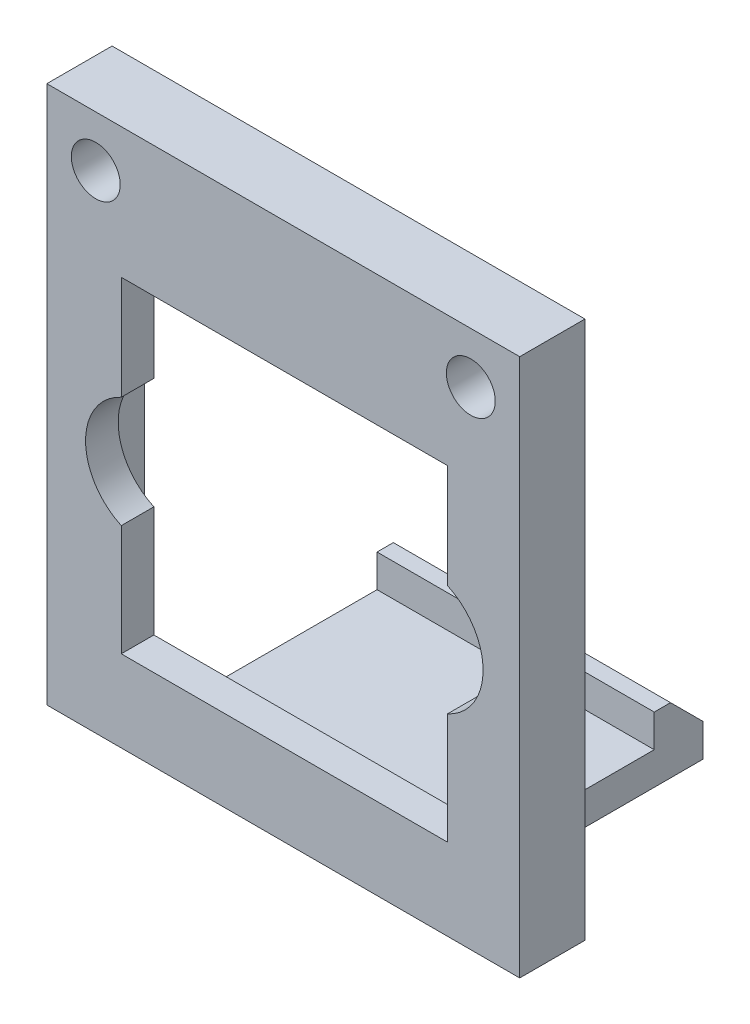
ISO-10303-21;
HEADER;
FILE_DESCRIPTION(('STEP AP214'),'2;1');
FILE_NAME('part.step','',(''),(''),'','','');
FILE_SCHEMA(('AUTOMOTIVE_DESIGN { 1 0 10303 214 1 1 1 1 }'));
ENDSEC;
DATA;
#1=APPLICATION_CONTEXT('core data for automotive mechanical design processes');
#2=APPLICATION_PROTOCOL_DEFINITION('international standard','automotive_design',2000,#1);
#3=PRODUCT_CONTEXT('',#1,'mechanical');
#4=PRODUCT('Part','Part','',(#3));
#5=PRODUCT_RELATED_PRODUCT_CATEGORY('part','',(#4));
#6=PRODUCT_DEFINITION_FORMATION('','',#4);
#7=PRODUCT_DEFINITION_CONTEXT('part definition',#1,'design');
#8=PRODUCT_DEFINITION('design','',#6,#7);
#9=PRODUCT_DEFINITION_SHAPE('','',#8);
#10=(LENGTH_UNIT() NAMED_UNIT(*) SI_UNIT(.MILLI.,.METRE.));
#11=(NAMED_UNIT(*) PLANE_ANGLE_UNIT() SI_UNIT($,.RADIAN.));
#12=(NAMED_UNIT(*) SI_UNIT($,.STERADIAN.) SOLID_ANGLE_UNIT());
#13=UNCERTAINTY_MEASURE_WITH_UNIT(LENGTH_MEASURE(1.E-05),#10,'distance_accuracy_value','');
#14=(GEOMETRIC_REPRESENTATION_CONTEXT(3) GLOBAL_UNCERTAINTY_ASSIGNED_CONTEXT((#13)) GLOBAL_UNIT_ASSIGNED_CONTEXT((#10,
#11,#12)) REPRESENTATION_CONTEXT('',''));
#15=CARTESIAN_POINT('',(0.,0.,0.));
#16=DIRECTION('',(0.,0.,1.));
#17=DIRECTION('',(1.,0.,0.));
#18=AXIS2_PLACEMENT_3D('',#15,#16,#17);
#19=CARTESIAN_POINT('',(0.,0.,0.));
#20=DIRECTION('',(0.,0.,-1.));
#21=DIRECTION('',(-1.,0.,0.));
#22=AXIS2_PLACEMENT_3D('',#19,#20,#21);
#23=PLANE('',#22);
#24=CARTESIAN_POINT('',(3.,52.385,0.));
#25=DIRECTION('',(0.,0.,1.));
#26=DIRECTION('',(1.,0.,0.));
#27=AXIS2_PLACEMENT_3D('',#24,#25,#26);
#28=CIRCLE('',#27,1.5);
#29=CARTESIAN_POINT('',(4.5,52.385,0.));
#30=VERTEX_POINT('',#29);
#31=EDGE_CURVE('E327',#30,#30,#28,.T.);
#32=ORIENTED_EDGE('',*,*,#31,.T.);
#33=EDGE_LOOP('',(#32));
#34=FACE_BOUND('',#33,.T.);
#35=CARTESIAN_POINT('',(26.,52.385,0.));
#36=DIRECTION('',(0.,0.,1.));
#37=DIRECTION('',(-1.,0.,0.));
#38=AXIS2_PLACEMENT_3D('',#35,#36,#37);
#39=CIRCLE('',#38,1.5);
#40=CARTESIAN_POINT('',(24.5,52.385,0.));
#41=VERTEX_POINT('',#40);
#42=EDGE_CURVE('E335',#41,#41,#39,.T.);
#43=ORIENTED_EDGE('',*,*,#42,.T.);
#44=EDGE_LOOP('',(#43));
#45=FACE_BOUND('',#44,.T.);
#46=DIRECTION('',(0.,1.,0.));
#47=VECTOR('',#46,1.);
#48=CARTESIAN_POINT('',(29.,0.,0.));
#49=LINE('',#48,#47);
#50=CARTESIAN_POINT('',(29.,22.5,0.));
#51=VERTEX_POINT('',#50);
#52=CARTESIAN_POINT('',(29.,55.5,0.));
#53=VERTEX_POINT('',#52);
#54=EDGE_CURVE('E220',#51,#53,#49,.T.);
#55=ORIENTED_EDGE('',*,*,#54,.F.);
#56=DIRECTION('',(-1.,0.,0.));
#57=VECTOR('',#56,1.);
#58=CARTESIAN_POINT('',(0.,22.5,0.));
#59=LINE('',#58,#57);
#60=CARTESIAN_POINT('',(23.,22.5,0.));
#61=VERTEX_POINT('',#60);
#62=EDGE_CURVE('E212',#51,#61,#59,.T.);
#63=ORIENTED_EDGE('',*,*,#62,.T.);
#64=DIRECTION('',(0.,1.,0.));
#65=VECTOR('',#64,1.);
#66=CARTESIAN_POINT('',(23.,24.5,0.));
#67=LINE('',#66,#65);
#68=CARTESIAN_POINT('',(23.,24.5,0.));
#69=VERTEX_POINT('',#68);
#70=EDGE_CURVE('E194',#61,#69,#67,.T.);
#71=ORIENTED_EDGE('',*,*,#70,.T.);
#72=DIRECTION('',(-1.,0.,0.));
#73=VECTOR('',#72,1.);
#74=CARTESIAN_POINT('',(27.,24.5,0.));
#75=LINE('',#74,#73);
#76=CARTESIAN_POINT('',(27.,24.5,0.));
#77=VERTEX_POINT('',#76);
#78=EDGE_CURVE('E313',#77,#69,#75,.T.);
#79=ORIENTED_EDGE('',*,*,#78,.F.);
#80=DIRECTION('',(0.,-1.,0.));
#81=VECTOR('',#80,1.);
#82=CARTESIAN_POINT('',(27.,49.5,0.));
#83=LINE('',#82,#81);
#84=CARTESIAN_POINT('',(27.,49.5,0.));
#85=VERTEX_POINT('',#84);
#86=EDGE_CURVE('E257',#85,#77,#83,.T.);
#87=ORIENTED_EDGE('',*,*,#86,.F.);
#88=DIRECTION('',(1.,0.,0.));
#89=VECTOR('',#88,1.);
#90=CARTESIAN_POINT('',(27.,49.5,0.));
#91=LINE('',#90,#89);
#92=CARTESIAN_POINT('',(1.99999999999999,49.5,0.));
#93=VERTEX_POINT('',#92);
#94=EDGE_CURVE('E298',#93,#85,#91,.T.);
#95=ORIENTED_EDGE('',*,*,#94,.F.);
#96=DIRECTION('',(0.,1.,0.));
#97=VECTOR('',#96,1.);
#98=CARTESIAN_POINT('',(1.99999999999999,49.5,0.));
#99=LINE('',#98,#97);
#100=CARTESIAN_POINT('',(2.,24.5,0.));
#101=VERTEX_POINT('',#100);
#102=EDGE_CURVE('E310',#101,#93,#99,.T.);
#103=ORIENTED_EDGE('',*,*,#102,.F.);
#104=CARTESIAN_POINT('',(6.00000000000001,24.5,0.));
#105=VERTEX_POINT('',#104);
#106=EDGE_CURVE('E249',#105,#101,#75,.T.);
#107=ORIENTED_EDGE('',*,*,#106,.F.);
#108=DIRECTION('',(0.,-1.,0.));
#109=VECTOR('',#108,1.);
#110=CARTESIAN_POINT('',(6.00000000000001,24.5,0.));
#111=LINE('',#110,#109);
#112=CARTESIAN_POINT('',(6.00000000000001,22.5,0.));
#113=VERTEX_POINT('',#112);
#114=EDGE_CURVE('E206',#105,#113,#111,.T.);
#115=ORIENTED_EDGE('',*,*,#114,.T.);
#116=CARTESIAN_POINT('',(0.,22.5,0.));
#117=VERTEX_POINT('',#116);
#118=EDGE_CURVE('E60',#113,#117,#59,.T.);
#119=ORIENTED_EDGE('',*,*,#118,.T.);
#120=DIRECTION('',(0.,-1.,0.));
#121=VECTOR('',#120,1.);
#122=CARTESIAN_POINT('',(0.,0.,0.));
#123=LINE('',#122,#121);
#124=CARTESIAN_POINT('',(0.,55.5,0.));
#125=VERTEX_POINT('',#124);
#126=EDGE_CURVE('E325',#125,#117,#123,.T.);
#127=ORIENTED_EDGE('',*,*,#126,.F.);
#128=DIRECTION('',(-1.,0.,0.));
#129=VECTOR('',#128,1.);
#130=CARTESIAN_POINT('',(0.,55.5,0.));
#131=LINE('',#130,#129);
#132=EDGE_CURVE('E321',#53,#125,#131,.T.);
#133=ORIENTED_EDGE('',*,*,#132,.F.);
#134=EDGE_LOOP('',(#55,#63,#71,#79,#87,#95,#103,#107,#115,#119,#127,#133));
#135=FACE_BOUND('',#134,.T.);
#136=ADVANCED_FACE('F34',(#34,#45,#135),#23,.T.);
#137=CARTESIAN_POINT('',(0.,0.,4.));
#138=DIRECTION('',(0.,0.,-1.));
#139=DIRECTION('',(-1.,0.,0.));
#140=AXIS2_PLACEMENT_3D('',#137,#138,#139);
#141=PLANE('',#140);
#142=CARTESIAN_POINT('',(6.12389813927912,37.7184229476218,4.));
#143=DIRECTION('',(0.,0.,-1.));
#144=DIRECTION('',(-1.,0.,0.));
#145=AXIS2_PLACEMENT_3D('',#142,#143,#144);
#146=CIRCLE('',#145,3.75);
#147=CARTESIAN_POINT('',(4.56389813927912,41.1285402476571,4.));
#148=VERTEX_POINT('',#147);
#149=CARTESIAN_POINT('',(4.56389813927912,34.3083056475865,4.));
#150=VERTEX_POINT('',#149);
#151=EDGE_CURVE('E341',#148,#150,#146,.F.);
#152=ORIENTED_EDGE('',*,*,#151,.F.);
#153=DIRECTION('',(0.,-1.,0.));
#154=VECTOR('',#153,1.);
#155=CARTESIAN_POINT('',(4.56389813927913,0.,4.));
#156=LINE('',#155,#154);
#157=CARTESIAN_POINT('',(4.56389813927911,47.5,4.));
#158=VERTEX_POINT('',#157);
#159=EDGE_CURVE('E358',#158,#148,#156,.T.);
#160=ORIENTED_EDGE('',*,*,#159,.F.);
#161=DIRECTION('',(-1.,0.,0.));
#162=VECTOR('',#161,1.);
#163=CARTESIAN_POINT('',(0.,47.5,4.));
#164=LINE('',#163,#162);
#165=CARTESIAN_POINT('',(24.5638981392791,47.5,4.));
#166=VERTEX_POINT('',#165);
#167=EDGE_CURVE('E355',#166,#158,#164,.T.);
#168=ORIENTED_EDGE('',*,*,#167,.F.);
#169=DIRECTION('',(0.,1.,0.));
#170=VECTOR('',#169,1.);
#171=CARTESIAN_POINT('',(24.5638981392791,0.,4.));
#172=LINE('',#171,#170);
#173=CARTESIAN_POINT('',(24.5638981392791,41.1285402476571,4.));
#174=VERTEX_POINT('',#173);
#175=EDGE_CURVE('E353',#174,#166,#172,.T.);
#176=ORIENTED_EDGE('',*,*,#175,.F.);
#177=CARTESIAN_POINT('',(23.0038981392791,37.7184229476218,4.));
#178=DIRECTION('',(0.,0.,-1.));
#179=DIRECTION('',(-1.,0.,0.));
#180=AXIS2_PLACEMENT_3D('',#177,#178,#179);
#181=CIRCLE('',#180,3.75);
#182=CARTESIAN_POINT('',(24.5638981392791,34.3083056475865,4.));
#183=VERTEX_POINT('',#182);
#184=EDGE_CURVE('E351',#183,#174,#181,.F.);
#185=ORIENTED_EDGE('',*,*,#184,.F.);
#186=DIRECTION('',(0.,1.,0.));
#187=VECTOR('',#186,1.);
#188=CARTESIAN_POINT('',(24.5638981392791,0.,4.));
#189=LINE('',#188,#187);
#190=CARTESIAN_POINT('',(24.5638981392791,27.5,4.));
#191=VERTEX_POINT('',#190);
#192=EDGE_CURVE('E349',#191,#183,#189,.T.);
#193=ORIENTED_EDGE('',*,*,#192,.F.);
#194=DIRECTION('',(1.,0.,0.));
#195=VECTOR('',#194,1.);
#196=CARTESIAN_POINT('',(0.,27.5,4.));
#197=LINE('',#196,#195);
#198=CARTESIAN_POINT('',(4.56389813927912,27.5,4.));
#199=VERTEX_POINT('',#198);
#200=EDGE_CURVE('E347',#199,#191,#197,.T.);
#201=ORIENTED_EDGE('',*,*,#200,.F.);
#202=DIRECTION('',(0.,-1.,0.));
#203=VECTOR('',#202,1.);
#204=CARTESIAN_POINT('',(4.56389813927912,0.,4.));
#205=LINE('',#204,#203);
#206=EDGE_CURVE('E345',#150,#199,#205,.T.);
#207=ORIENTED_EDGE('',*,*,#206,.F.);
#208=EDGE_LOOP('',(#152,#160,#168,#176,#185,#193,#201,#207));
#209=FACE_BOUND('',#208,.T.);
#210=CARTESIAN_POINT('',(26.,52.385,4.));
#211=DIRECTION('',(0.,0.,1.));
#212=DIRECTION('',(-1.,0.,0.));
#213=AXIS2_PLACEMENT_3D('',#210,#211,#212);
#214=CIRCLE('',#213,1.5);
#215=CARTESIAN_POINT('',(24.5,52.385,4.));
#216=VERTEX_POINT('',#215);
#217=EDGE_CURVE('E338',#216,#216,#214,.T.);
#218=ORIENTED_EDGE('',*,*,#217,.F.);
#219=EDGE_LOOP('',(#218));
#220=FACE_BOUND('',#219,.T.);
#221=CARTESIAN_POINT('',(3.,52.385,4.));
#222=DIRECTION('',(0.,0.,1.));
#223=DIRECTION('',(1.,0.,0.));
#224=AXIS2_PLACEMENT_3D('',#221,#222,#223);
#225=CIRCLE('',#224,1.5);
#226=CARTESIAN_POINT('',(4.5,52.385,4.));
#227=VERTEX_POINT('',#226);
#228=EDGE_CURVE('E332',#227,#227,#225,.T.);
#229=ORIENTED_EDGE('',*,*,#228,.F.);
#230=EDGE_LOOP('',(#229));
#231=FACE_BOUND('',#230,.T.);
#232=DIRECTION('',(-1.,0.,0.));
#233=VECTOR('',#232,1.);
#234=CARTESIAN_POINT('',(0.,22.5,4.));
#235=LINE('',#234,#233);
#236=CARTESIAN_POINT('',(29.,22.5,4.));
#237=VERTEX_POINT('',#236);
#238=CARTESIAN_POINT('',(0.,22.5,4.));
#239=VERTEX_POINT('',#238);
#240=EDGE_CURVE('E226',#237,#239,#235,.T.);
#241=ORIENTED_EDGE('',*,*,#240,.F.);
#242=DIRECTION('',(0.,1.,0.));
#243=VECTOR('',#242,1.);
#244=CARTESIAN_POINT('',(29.,0.,4.));
#245=LINE('',#244,#243);
#246=CARTESIAN_POINT('',(29.,55.5,4.));
#247=VERTEX_POINT('',#246);
#248=EDGE_CURVE('E329',#237,#247,#245,.T.);
#249=ORIENTED_EDGE('',*,*,#248,.T.);
#250=DIRECTION('',(-1.,0.,0.));
#251=VECTOR('',#250,1.);
#252=CARTESIAN_POINT('',(0.,55.5,4.));
#253=LINE('',#252,#251);
#254=CARTESIAN_POINT('',(0.,55.5,4.));
#255=VERTEX_POINT('',#254);
#256=EDGE_CURVE('E320',#247,#255,#253,.T.);
#257=ORIENTED_EDGE('',*,*,#256,.T.);
#258=DIRECTION('',(0.,-1.,0.));
#259=VECTOR('',#258,1.);
#260=CARTESIAN_POINT('',(0.,0.,4.));
#261=LINE('',#260,#259);
#262=EDGE_CURVE('E323',#255,#239,#261,.T.);
#263=ORIENTED_EDGE('',*,*,#262,.T.);
#264=EDGE_LOOP('',(#241,#249,#257,#263));
#265=FACE_BOUND('',#264,.T.);
#266=ADVANCED_FACE('F442',(#209,#220,#231,#265),#141,.F.);
#267=CARTESIAN_POINT('',(0.,0.,4.));
#268=DIRECTION('',(1.,0.,0.));
#269=DIRECTION('',(0.,0.,-1.));
#270=AXIS2_PLACEMENT_3D('',#267,#268,#269);
#271=PLANE('',#270);
#272=DIRECTION('',(0.,0.,-1.));
#273=VECTOR('',#272,1.);
#274=CARTESIAN_POINT('',(0.,22.5,4.));
#275=LINE('',#274,#273);
#276=EDGE_CURVE('E52',#239,#117,#275,.T.);
#277=ORIENTED_EDGE('',*,*,#276,.F.);
#278=ORIENTED_EDGE('',*,*,#262,.F.);
#279=DIRECTION('',(0.,0.,-1.));
#280=VECTOR('',#279,1.);
#281=CARTESIAN_POINT('',(0.,55.5,4.));
#282=LINE('',#281,#280);
#283=EDGE_CURVE('E317',#255,#125,#282,.T.);
#284=ORIENTED_EDGE('',*,*,#283,.T.);
#285=ORIENTED_EDGE('',*,*,#126,.T.);
#286=EDGE_LOOP('',(#277,#278,#284,#285));
#287=FACE_BOUND('',#286,.T.);
#288=ADVANCED_FACE('F36',(#287),#271,.F.);
#289=CARTESIAN_POINT('',(29.,0.,4.));
#290=DIRECTION('',(-1.,0.,0.));
#291=DIRECTION('',(0.,0.,1.));
#292=AXIS2_PLACEMENT_3D('',#289,#290,#291);
#293=PLANE('',#292);
#294=DIRECTION('',(0.,0.,1.));
#295=VECTOR('',#294,1.);
#296=CARTESIAN_POINT('',(29.,22.5,4.));
#297=LINE('',#296,#295);
#298=EDGE_CURVE('E222',#51,#237,#297,.T.);
#299=ORIENTED_EDGE('',*,*,#298,.F.);
#300=ORIENTED_EDGE('',*,*,#54,.T.);
#301=DIRECTION('',(0.,0.,-1.));
#302=VECTOR('',#301,1.);
#303=CARTESIAN_POINT('',(29.,55.5,4.));
#304=LINE('',#303,#302);
#305=EDGE_CURVE('E44',#247,#53,#304,.T.);
#306=ORIENTED_EDGE('',*,*,#305,.F.);
#307=ORIENTED_EDGE('',*,*,#248,.F.);
#308=EDGE_LOOP('',(#299,#300,#306,#307));
#309=FACE_BOUND('',#308,.T.);
#310=ADVANCED_FACE('F458',(#309),#293,.F.);
#311=CARTESIAN_POINT('',(6.12389813927912,37.7184229476218,10.));
#312=DIRECTION('',(0.,0.,-1.));
#313=DIRECTION('',(-1.,0.,0.));
#314=AXIS2_PLACEMENT_3D('',#311,#312,#313);
#315=CYLINDRICAL_SURFACE('',#314,3.75);
#316=DIRECTION('',(0.,0.,-1.));
#317=VECTOR('',#316,1.);
#318=CARTESIAN_POINT('',(4.56389813927912,34.3083056475865,10.));
#319=LINE('',#318,#317);
#320=CARTESIAN_POINT('',(4.56389813927912,34.3083056475865,2.));
#321=VERTEX_POINT('',#320);
#322=EDGE_CURVE('E360',#150,#321,#319,.T.);
#323=ORIENTED_EDGE('',*,*,#322,.T.);
#324=CARTESIAN_POINT('',(6.12389813927912,37.7184229476218,2.));
#325=DIRECTION('',(0.,0.,-1.));
#326=DIRECTION('',(-1.,0.,0.));
#327=AXIS2_PLACEMENT_3D('',#324,#325,#326);
#328=CIRCLE('',#327,3.75);
#329=CARTESIAN_POINT('',(4.56389813927912,41.1285402476571,2.));
#330=VERTEX_POINT('',#329);
#331=EDGE_CURVE('E384',#321,#330,#328,.T.);
#332=ORIENTED_EDGE('',*,*,#331,.T.);
#333=DIRECTION('',(0.,0.,-1.));
#334=VECTOR('',#333,1.);
#335=CARTESIAN_POINT('',(4.56389813927912,41.1285402476571,10.));
#336=LINE('',#335,#334);
#337=EDGE_CURVE('E381',#148,#330,#336,.T.);
#338=ORIENTED_EDGE('',*,*,#337,.F.);
#339=ORIENTED_EDGE('',*,*,#151,.T.);
#340=EDGE_LOOP('',(#323,#332,#338,#339));
#341=FACE_BOUND('',#340,.T.);
#342=ADVANCED_FACE('F460',(#341),#315,.F.);
#343=CARTESIAN_POINT('',(4.56389813927912,34.3083056475865,10.));
#344=DIRECTION('',(1.,0.,0.));
#345=DIRECTION('',(0.,0.,-1.));
#346=AXIS2_PLACEMENT_3D('',#343,#344,#345);
#347=PLANE('',#346);
#348=DIRECTION('',(0.,0.,-1.));
#349=VECTOR('',#348,1.);
#350=CARTESIAN_POINT('',(4.56389813927912,27.5,10.));
#351=LINE('',#350,#349);
#352=CARTESIAN_POINT('',(4.56389813927912,27.5,2.));
#353=VERTEX_POINT('',#352);
#354=EDGE_CURVE('E363',#199,#353,#351,.T.);
#355=ORIENTED_EDGE('',*,*,#354,.T.);
#356=DIRECTION('',(0.,1.,0.));
#357=VECTOR('',#356,1.);
#358=CARTESIAN_POINT('',(4.56389813927912,34.3083056475865,2.));
#359=LINE('',#358,#357);
#360=EDGE_CURVE('E387',#353,#321,#359,.T.);
#361=ORIENTED_EDGE('',*,*,#360,.T.);
#362=ORIENTED_EDGE('',*,*,#322,.F.);
#363=ORIENTED_EDGE('',*,*,#206,.T.);
#364=EDGE_LOOP('',(#355,#361,#362,#363));
#365=FACE_BOUND('',#364,.T.);
#366=ADVANCED_FACE('F466',(#365),#347,.T.);
#367=CARTESIAN_POINT('',(4.56389813927912,27.5,10.));
#368=DIRECTION('',(0.,1.,0.));
#369=DIRECTION('',(-1.,0.,0.));
#370=AXIS2_PLACEMENT_3D('',#367,#368,#369);
#371=PLANE('',#370);
#372=DIRECTION('',(0.,0.,-1.));
#373=VECTOR('',#372,1.);
#374=CARTESIAN_POINT('',(24.5638981392791,27.5,10.));
#375=LINE('',#374,#373);
#376=CARTESIAN_POINT('',(24.5638981392791,27.5,2.));
#377=VERTEX_POINT('',#376);
#378=EDGE_CURVE('E366',#191,#377,#375,.T.);
#379=ORIENTED_EDGE('',*,*,#378,.T.);
#380=DIRECTION('',(-1.,0.,0.));
#381=VECTOR('',#380,1.);
#382=CARTESIAN_POINT('',(4.56389813927912,27.5,2.));
#383=LINE('',#382,#381);
#384=EDGE_CURVE('E390',#377,#353,#383,.T.);
#385=ORIENTED_EDGE('',*,*,#384,.T.);
#386=ORIENTED_EDGE('',*,*,#354,.F.);
#387=ORIENTED_EDGE('',*,*,#200,.T.);
#388=EDGE_LOOP('',(#379,#385,#386,#387));
#389=FACE_BOUND('',#388,.T.);
#390=ADVANCED_FACE('F623',(#389),#371,.T.);
#391=CARTESIAN_POINT('',(24.5638981392791,34.3083056475865,10.));
#392=DIRECTION('',(-1.,0.,0.));
#393=DIRECTION('',(0.,-1.,0.));
#394=AXIS2_PLACEMENT_3D('',#391,#392,#393);
#395=PLANE('',#394);
#396=DIRECTION('',(0.,0.,-1.));
#397=VECTOR('',#396,1.);
#398=CARTESIAN_POINT('',(24.5638981392791,34.3083056475865,10.));
#399=LINE('',#398,#397);
#400=CARTESIAN_POINT('',(24.5638981392791,34.3083056475865,2.));
#401=VERTEX_POINT('',#400);
#402=EDGE_CURVE('E369',#183,#401,#399,.T.);
#403=ORIENTED_EDGE('',*,*,#402,.T.);
#404=DIRECTION('',(0.,-1.,0.));
#405=VECTOR('',#404,1.);
#406=CARTESIAN_POINT('',(24.5638981392791,34.3083056475865,2.));
#407=LINE('',#406,#405);
#408=EDGE_CURVE('E393',#401,#377,#407,.T.);
#409=ORIENTED_EDGE('',*,*,#408,.T.);
#410=ORIENTED_EDGE('',*,*,#378,.F.);
#411=ORIENTED_EDGE('',*,*,#192,.T.);
#412=EDGE_LOOP('',(#403,#409,#410,#411));
#413=FACE_BOUND('',#412,.T.);
#414=ADVANCED_FACE('F613',(#413),#395,.T.);
#415=CARTESIAN_POINT('',(23.0038981392791,37.7184229476218,10.));
#416=DIRECTION('',(0.,0.,-1.));
#417=DIRECTION('',(-1.,0.,0.));
#418=AXIS2_PLACEMENT_3D('',#415,#416,#417);
#419=CYLINDRICAL_SURFACE('',#418,3.75);
#420=DIRECTION('',(0.,0.,-1.));
#421=VECTOR('',#420,1.);
#422=CARTESIAN_POINT('',(24.5638981392791,41.1285402476571,10.));
#423=LINE('',#422,#421);
#424=CARTESIAN_POINT('',(24.5638981392791,41.1285402476571,2.));
#425=VERTEX_POINT('',#424);
#426=EDGE_CURVE('E372',#174,#425,#423,.T.);
#427=ORIENTED_EDGE('',*,*,#426,.T.);
#428=CARTESIAN_POINT('',(23.0038981392791,37.7184229476218,2.));
#429=DIRECTION('',(0.,0.,-1.));
#430=DIRECTION('',(-1.,0.,0.));
#431=AXIS2_PLACEMENT_3D('',#428,#429,#430);
#432=CIRCLE('',#431,3.75);
#433=EDGE_CURVE('E396',#425,#401,#432,.T.);
#434=ORIENTED_EDGE('',*,*,#433,.T.);
#435=ORIENTED_EDGE('',*,*,#402,.F.);
#436=ORIENTED_EDGE('',*,*,#184,.T.);
#437=EDGE_LOOP('',(#427,#434,#435,#436));
#438=FACE_BOUND('',#437,.T.);
#439=ADVANCED_FACE('F603',(#438),#419,.F.);
#440=CARTESIAN_POINT('',(24.5638981392791,47.5,10.));
#441=DIRECTION('',(-1.,0.,0.));
#442=DIRECTION('',(0.,0.,1.));
#443=AXIS2_PLACEMENT_3D('',#440,#441,#442);
#444=PLANE('',#443);
#445=DIRECTION('',(0.,0.,-1.));
#446=VECTOR('',#445,1.);
#447=CARTESIAN_POINT('',(24.5638981392791,47.5,10.));
#448=LINE('',#447,#446);
#449=CARTESIAN_POINT('',(24.5638981392791,47.5,2.));
#450=VERTEX_POINT('',#449);
#451=EDGE_CURVE('E375',#166,#450,#448,.T.);
#452=ORIENTED_EDGE('',*,*,#451,.T.);
#453=DIRECTION('',(0.,-1.,0.));
#454=VECTOR('',#453,1.);
#455=CARTESIAN_POINT('',(24.5638981392791,47.5,2.));
#456=LINE('',#455,#454);
#457=EDGE_CURVE('E399',#450,#425,#456,.T.);
#458=ORIENTED_EDGE('',*,*,#457,.T.);
#459=ORIENTED_EDGE('',*,*,#426,.F.);
#460=ORIENTED_EDGE('',*,*,#175,.T.);
#461=EDGE_LOOP('',(#452,#458,#459,#460));
#462=FACE_BOUND('',#461,.T.);
#463=ADVANCED_FACE('F593',(#462),#444,.T.);
#464=CARTESIAN_POINT('',(4.56389813927911,47.5,10.));
#465=DIRECTION('',(0.,-1.,0.));
#466=DIRECTION('',(0.,0.,-1.));
#467=AXIS2_PLACEMENT_3D('',#464,#465,#466);
#468=PLANE('',#467);
#469=DIRECTION('',(0.,0.,-1.));
#470=VECTOR('',#469,1.);
#471=CARTESIAN_POINT('',(4.56389813927911,47.5,10.));
#472=LINE('',#471,#470);
#473=CARTESIAN_POINT('',(4.56389813927911,47.5,2.));
#474=VERTEX_POINT('',#473);
#475=EDGE_CURVE('E378',#158,#474,#472,.T.);
#476=ORIENTED_EDGE('',*,*,#475,.T.);
#477=DIRECTION('',(1.,0.,0.));
#478=VECTOR('',#477,1.);
#479=CARTESIAN_POINT('',(4.56389813927911,47.5,2.));
#480=LINE('',#479,#478);
#481=EDGE_CURVE('E402',#474,#450,#480,.T.);
#482=ORIENTED_EDGE('',*,*,#481,.T.);
#483=ORIENTED_EDGE('',*,*,#451,.F.);
#484=ORIENTED_EDGE('',*,*,#167,.T.);
#485=EDGE_LOOP('',(#476,#482,#483,#484));
#486=FACE_BOUND('',#485,.T.);
#487=ADVANCED_FACE('F582',(#486),#468,.T.);
#488=CARTESIAN_POINT('',(4.56389813927911,47.5,10.));
#489=DIRECTION('',(1.,0.,0.));
#490=DIRECTION('',(0.,1.,0.));
#491=AXIS2_PLACEMENT_3D('',#488,#489,#490);
#492=PLANE('',#491);
#493=ORIENTED_EDGE('',*,*,#337,.T.);
#494=DIRECTION('',(0.,1.,0.));
#495=VECTOR('',#494,1.);
#496=CARTESIAN_POINT('',(4.56389813927911,47.5,2.));
#497=LINE('',#496,#495);
#498=EDGE_CURVE('E12',#330,#474,#497,.T.);
#499=ORIENTED_EDGE('',*,*,#498,.T.);
#500=ORIENTED_EDGE('',*,*,#475,.F.);
#501=ORIENTED_EDGE('',*,*,#159,.T.);
#502=EDGE_LOOP('',(#493,#499,#500,#501));
#503=FACE_BOUND('',#502,.T.);
#504=ADVANCED_FACE('F456',(#503),#492,.T.);
#505=CARTESIAN_POINT('',(0.,55.5,4.));
#506=DIRECTION('',(0.,-1.,0.));
#507=DIRECTION('',(0.,0.,-1.));
#508=AXIS2_PLACEMENT_3D('',#505,#506,#507);
#509=PLANE('',#508);
#510=ORIENTED_EDGE('',*,*,#132,.T.);
#511=ORIENTED_EDGE('',*,*,#283,.F.);
#512=ORIENTED_EDGE('',*,*,#256,.F.);
#513=ORIENTED_EDGE('',*,*,#305,.T.);
#514=EDGE_LOOP('',(#510,#511,#512,#513));
#515=FACE_BOUND('',#514,.T.);
#516=ADVANCED_FACE('F453',(#515),#509,.F.);
#517=CARTESIAN_POINT('',(3.,52.385,0.));
#518=DIRECTION('',(0.,0.,1.));
#519=DIRECTION('',(1.,0.,0.));
#520=AXIS2_PLACEMENT_3D('',#517,#518,#519);
#521=CYLINDRICAL_SURFACE('',#520,1.5);
#522=ORIENTED_EDGE('',*,*,#31,.F.);
#523=EDGE_LOOP('',(#522));
#524=FACE_BOUND('',#523,.T.);
#525=ORIENTED_EDGE('',*,*,#228,.T.);
#526=EDGE_LOOP('',(#525));
#527=FACE_BOUND('',#526,.T.);
#528=ADVANCED_FACE('F455',(#524,#527),#521,.F.);
#529=CARTESIAN_POINT('',(26.,52.385,0.));
#530=DIRECTION('',(0.,0.,1.));
#531=DIRECTION('',(1.,0.,0.));
#532=AXIS2_PLACEMENT_3D('',#529,#530,#531);
#533=CYLINDRICAL_SURFACE('',#532,1.5);
#534=ORIENTED_EDGE('',*,*,#42,.F.);
#535=EDGE_LOOP('',(#534));
#536=FACE_BOUND('',#535,.T.);
#537=ORIENTED_EDGE('',*,*,#217,.T.);
#538=EDGE_LOOP('',(#537));
#539=FACE_BOUND('',#538,.T.);
#540=ADVANCED_FACE('F438',(#536,#539),#533,.F.);
#541=CARTESIAN_POINT('',(27.,49.5,2.));
#542=DIRECTION('',(1.,0.,0.));
#543=DIRECTION('',(0.,1.,0.));
#544=AXIS2_PLACEMENT_3D('',#541,#542,#543);
#545=PLANE('',#544);
#546=ORIENTED_EDGE('',*,*,#86,.T.);
#547=DIRECTION('',(0.,0.,-1.));
#548=VECTOR('',#547,1.);
#549=CARTESIAN_POINT('',(27.,24.5,2.));
#550=LINE('',#549,#548);
#551=CARTESIAN_POINT('',(27.,24.5,2.));
#552=VERTEX_POINT('',#551);
#553=EDGE_CURVE('E307',#552,#77,#550,.T.);
#554=ORIENTED_EDGE('',*,*,#553,.F.);
#555=DIRECTION('',(0.,-1.,0.));
#556=VECTOR('',#555,1.);
#557=CARTESIAN_POINT('',(27.,49.5,2.));
#558=LINE('',#557,#556);
#559=CARTESIAN_POINT('',(27.,49.5,2.));
#560=VERTEX_POINT('',#559);
#561=EDGE_CURVE('E294',#560,#552,#558,.T.);
#562=ORIENTED_EDGE('',*,*,#561,.F.);
#563=DIRECTION('',(0.,0.,-1.));
#564=VECTOR('',#563,1.);
#565=CARTESIAN_POINT('',(27.,49.5,2.));
#566=LINE('',#565,#564);
#567=EDGE_CURVE('E405',#560,#85,#566,.T.);
#568=ORIENTED_EDGE('',*,*,#567,.T.);
#569=EDGE_LOOP('',(#546,#554,#562,#568));
#570=FACE_BOUND('',#569,.T.);
#571=ADVANCED_FACE('F423',(#570),#545,.F.);
#572=CARTESIAN_POINT('',(27.,49.5,2.));
#573=DIRECTION('',(0.,1.,0.));
#574=DIRECTION('',(0.,0.,1.));
#575=AXIS2_PLACEMENT_3D('',#572,#573,#574);
#576=PLANE('',#575);
#577=ORIENTED_EDGE('',*,*,#94,.T.);
#578=ORIENTED_EDGE('',*,*,#567,.F.);
#579=DIRECTION('',(1.,0.,0.));
#580=VECTOR('',#579,1.);
#581=CARTESIAN_POINT('',(27.,49.5,2.));
#582=LINE('',#581,#580);
#583=CARTESIAN_POINT('',(1.99999999999999,49.5,2.));
#584=VERTEX_POINT('',#583);
#585=EDGE_CURVE('E304',#584,#560,#582,.T.);
#586=ORIENTED_EDGE('',*,*,#585,.F.);
#587=DIRECTION('',(0.,0.,-1.));
#588=VECTOR('',#587,1.);
#589=CARTESIAN_POINT('',(1.99999999999999,49.5,2.));
#590=LINE('',#589,#588);
#591=EDGE_CURVE('E411',#584,#93,#590,.T.);
#592=ORIENTED_EDGE('',*,*,#591,.T.);
#593=EDGE_LOOP('',(#577,#578,#586,#592));
#594=FACE_BOUND('',#593,.T.);
#595=ADVANCED_FACE('F430',(#594),#576,.F.);
#596=CARTESIAN_POINT('',(1.99999999999999,49.5,2.));
#597=DIRECTION('',(-1.,0.,0.));
#598=DIRECTION('',(0.,-1.,0.));
#599=AXIS2_PLACEMENT_3D('',#596,#597,#598);
#600=PLANE('',#599);
#601=ORIENTED_EDGE('',*,*,#102,.T.);
#602=ORIENTED_EDGE('',*,*,#591,.F.);
#603=DIRECTION('',(0.,1.,0.));
#604=VECTOR('',#603,1.);
#605=CARTESIAN_POINT('',(1.99999999999999,49.5,2.));
#606=LINE('',#605,#604);
#607=CARTESIAN_POINT('',(2.,24.5,2.));
#608=VERTEX_POINT('',#607);
#609=EDGE_CURVE('E301',#608,#584,#606,.T.);
#610=ORIENTED_EDGE('',*,*,#609,.F.);
#611=DIRECTION('',(0.,0.,-1.));
#612=VECTOR('',#611,1.);
#613=CARTESIAN_POINT('',(2.,24.5,2.));
#614=LINE('',#613,#612);
#615=EDGE_CURVE('E408',#608,#101,#614,.T.);
#616=ORIENTED_EDGE('',*,*,#615,.T.);
#617=EDGE_LOOP('',(#601,#602,#610,#616));
#618=FACE_BOUND('',#617,.T.);
#619=ADVANCED_FACE('F420',(#618),#600,.F.);
#620=CARTESIAN_POINT('',(27.,24.5,2.));
#621=DIRECTION('',(0.,-1.,0.));
#622=DIRECTION('',(0.,0.,-1.));
#623=AXIS2_PLACEMENT_3D('',#620,#621,#622);
#624=PLANE('',#623);
#625=ORIENTED_EDGE('',*,*,#78,.T.);
#626=DIRECTION('',(0.,0.,1.));
#627=VECTOR('',#626,1.);
#628=CARTESIAN_POINT('',(23.,24.5,-10.25));
#629=LINE('',#628,#627);
#630=CARTESIAN_POINT('',(23.,24.5,-10.25));
#631=VERTEX_POINT('',#630);
#632=EDGE_CURVE('E202',#631,#69,#629,.T.);
#633=ORIENTED_EDGE('',*,*,#632,.F.);
#634=DIRECTION('',(-1.,0.,0.));
#635=VECTOR('',#634,1.);
#636=CARTESIAN_POINT('',(6.00000000000001,24.5,-10.25));
#637=LINE('',#636,#635);
#638=CARTESIAN_POINT('',(6.00000000000001,24.5,-10.25));
#639=VERTEX_POINT('',#638);
#640=EDGE_CURVE('E38',#631,#639,#637,.T.);
#641=ORIENTED_EDGE('',*,*,#640,.T.);
#642=DIRECTION('',(0.,0.,1.));
#643=VECTOR('',#642,1.);
#644=CARTESIAN_POINT('',(6.00000000000001,24.5,-10.25));
#645=LINE('',#644,#643);
#646=EDGE_CURVE('E253',#639,#105,#645,.T.);
#647=ORIENTED_EDGE('',*,*,#646,.T.);
#648=ORIENTED_EDGE('',*,*,#106,.T.);
#649=ORIENTED_EDGE('',*,*,#615,.F.);
#650=DIRECTION('',(-1.,0.,0.));
#651=VECTOR('',#650,1.);
#652=CARTESIAN_POINT('',(27.,24.5,2.));
#653=LINE('',#652,#651);
#654=EDGE_CURVE('E297',#552,#608,#653,.T.);
#655=ORIENTED_EDGE('',*,*,#654,.F.);
#656=ORIENTED_EDGE('',*,*,#553,.T.);
#657=EDGE_LOOP('',(#625,#633,#641,#647,#648,#649,#655,#656));
#658=FACE_BOUND('',#657,.T.);
#659=ADVANCED_FACE('F426',(#658),#624,.F.);
#660=CARTESIAN_POINT('',(0.,0.,2.));
#661=DIRECTION('',(0.,0.,-1.));
#662=DIRECTION('',(-1.,0.,0.));
#663=AXIS2_PLACEMENT_3D('',#660,#661,#662);
#664=PLANE('',#663);
#665=ORIENTED_EDGE('',*,*,#360,.F.);
#666=ORIENTED_EDGE('',*,*,#384,.F.);
#667=ORIENTED_EDGE('',*,*,#408,.F.);
#668=ORIENTED_EDGE('',*,*,#433,.F.);
#669=ORIENTED_EDGE('',*,*,#457,.F.);
#670=ORIENTED_EDGE('',*,*,#481,.F.);
#671=ORIENTED_EDGE('',*,*,#498,.F.);
#672=ORIENTED_EDGE('',*,*,#331,.F.);
#673=EDGE_LOOP('',(#665,#666,#667,#668,#669,#670,#671,#672));
#674=FACE_BOUND('',#673,.T.);
#675=ORIENTED_EDGE('',*,*,#561,.T.);
#676=ORIENTED_EDGE('',*,*,#654,.T.);
#677=ORIENTED_EDGE('',*,*,#609,.T.);
#678=ORIENTED_EDGE('',*,*,#585,.T.);
#679=EDGE_LOOP('',(#675,#676,#677,#678));
#680=FACE_BOUND('',#679,.T.);
#681=ADVANCED_FACE('F428',(#674,#680),#664,.T.);
#682=CARTESIAN_POINT('',(6.00000000000001,24.5,-10.25));
#683=DIRECTION('',(-1.,0.,0.));
#684=DIRECTION('',(0.,-1.,0.));
#685=AXIS2_PLACEMENT_3D('',#682,#683,#684);
#686=PLANE('',#685);
#687=ORIENTED_EDGE('',*,*,#114,.F.);
#688=ORIENTED_EDGE('',*,*,#646,.F.);
#689=DIRECTION('',(0.,-1.,0.));
#690=VECTOR('',#689,1.);
#691=CARTESIAN_POINT('',(6.00000000000001,22.5,-10.25));
#692=LINE('',#691,#690);
#693=CARTESIAN_POINT('',(6.00000000000001,26.5,-10.25));
#694=VERTEX_POINT('',#693);
#695=EDGE_CURVE('E240',#694,#639,#692,.T.);
#696=ORIENTED_EDGE('',*,*,#695,.F.);
#697=DIRECTION('',(0.,0.,1.));
#698=VECTOR('',#697,1.);
#699=CARTESIAN_POINT('',(6.00000000000001,26.5,-10.25));
#700=LINE('',#699,#698);
#701=CARTESIAN_POINT('',(6.00000000000001,26.5,-11.25));
#702=VERTEX_POINT('',#701);
#703=EDGE_CURVE('E270',#702,#694,#700,.T.);
#704=ORIENTED_EDGE('',*,*,#703,.F.);
#705=DIRECTION('',(0.,0.707106781186547,0.707106781186548));
#706=VECTOR('',#705,1.);
#707=CARTESIAN_POINT('',(6.00000000000001,26.5,-11.25));
#708=LINE('',#707,#706);
#709=CARTESIAN_POINT('',(6.00000000000001,24.5,-13.25));
#710=VERTEX_POINT('',#709);
#711=EDGE_CURVE('E267',#710,#702,#708,.T.);
#712=ORIENTED_EDGE('',*,*,#711,.F.);
#713=DIRECTION('',(0.,1.,0.));
#714=VECTOR('',#713,1.);
#715=CARTESIAN_POINT('',(6.00000000000001,24.5,-13.25));
#716=LINE('',#715,#714);
#717=CARTESIAN_POINT('',(6.00000000000001,22.5,-13.25));
#718=VERTEX_POINT('',#717);
#719=EDGE_CURVE('E239',#718,#710,#716,.T.);
#720=ORIENTED_EDGE('',*,*,#719,.F.);
#721=DIRECTION('',(0.,0.,1.));
#722=VECTOR('',#721,1.);
#723=CARTESIAN_POINT('',(6.00000000000001,22.5,-10.25));
#724=LINE('',#723,#722);
#725=EDGE_CURVE('E216',#718,#113,#724,.T.);
#726=ORIENTED_EDGE('',*,*,#725,.T.);
#727=EDGE_LOOP('',(#687,#688,#696,#704,#712,#720,#726));
#728=FACE_BOUND('',#727,.T.);
#729=ADVANCED_FACE('F534',(#728),#686,.T.);
#730=CARTESIAN_POINT('',(23.,24.5,-10.25));
#731=DIRECTION('',(1.,0.,0.));
#732=DIRECTION('',(0.,0.,-1.));
#733=AXIS2_PLACEMENT_3D('',#730,#731,#732);
#734=PLANE('',#733);
#735=ORIENTED_EDGE('',*,*,#70,.F.);
#736=DIRECTION('',(0.,0.,1.));
#737=VECTOR('',#736,1.);
#738=CARTESIAN_POINT('',(23.,22.5,-10.25));
#739=LINE('',#738,#737);
#740=CARTESIAN_POINT('',(23.,22.5,-13.25));
#741=VERTEX_POINT('',#740);
#742=EDGE_CURVE('E198',#741,#61,#739,.T.);
#743=ORIENTED_EDGE('',*,*,#742,.F.);
#744=DIRECTION('',(0.,1.,0.));
#745=VECTOR('',#744,1.);
#746=CARTESIAN_POINT('',(23.,24.5,-13.25));
#747=LINE('',#746,#745);
#748=CARTESIAN_POINT('',(23.,24.5,-13.25));
#749=VERTEX_POINT('',#748);
#750=EDGE_CURVE('E221',#741,#749,#747,.T.);
#751=ORIENTED_EDGE('',*,*,#750,.T.);
#752=DIRECTION('',(0.,0.707106781186547,0.707106781186548));
#753=VECTOR('',#752,1.);
#754=CARTESIAN_POINT('',(23.,26.5,-11.25));
#755=LINE('',#754,#753);
#756=CARTESIAN_POINT('',(23.,26.5,-11.25));
#757=VERTEX_POINT('',#756);
#758=EDGE_CURVE('E224',#749,#757,#755,.T.);
#759=ORIENTED_EDGE('',*,*,#758,.T.);
#760=DIRECTION('',(0.,0.,1.));
#761=VECTOR('',#760,1.);
#762=CARTESIAN_POINT('',(23.,26.5,-10.25));
#763=LINE('',#762,#761);
#764=CARTESIAN_POINT('',(23.,26.5,-10.25));
#765=VERTEX_POINT('',#764);
#766=EDGE_CURVE('E234',#757,#765,#763,.T.);
#767=ORIENTED_EDGE('',*,*,#766,.T.);
#768=DIRECTION('',(0.,-1.,0.));
#769=VECTOR('',#768,1.);
#770=CARTESIAN_POINT('',(23.,22.5,-10.25));
#771=LINE('',#770,#769);
#772=EDGE_CURVE('E237',#765,#631,#771,.T.);
#773=ORIENTED_EDGE('',*,*,#772,.T.);
#774=ORIENTED_EDGE('',*,*,#632,.T.);
#775=EDGE_LOOP('',(#735,#743,#751,#759,#767,#773,#774));
#776=FACE_BOUND('',#775,.T.);
#777=ADVANCED_FACE('F196',(#776),#734,.T.);
#778=CARTESIAN_POINT('',(6.00000000000001,22.5,-10.25));
#779=DIRECTION('',(0.,-1.,0.));
#780=DIRECTION('',(0.,0.,-1.));
#781=AXIS2_PLACEMENT_3D('',#778,#779,#780);
#782=PLANE('',#781);
#783=ORIENTED_EDGE('',*,*,#742,.T.);
#784=ORIENTED_EDGE('',*,*,#62,.F.);
#785=ORIENTED_EDGE('',*,*,#298,.T.);
#786=ORIENTED_EDGE('',*,*,#240,.T.);
#787=ORIENTED_EDGE('',*,*,#276,.T.);
#788=ORIENTED_EDGE('',*,*,#118,.F.);
#789=ORIENTED_EDGE('',*,*,#725,.F.);
#790=DIRECTION('',(1.,0.,0.));
#791=VECTOR('',#790,1.);
#792=CARTESIAN_POINT('',(1.00000000000001,22.5,-13.25));
#793=LINE('',#792,#791);
#794=EDGE_CURVE('E214',#718,#741,#793,.T.);
#795=ORIENTED_EDGE('',*,*,#794,.T.);
#796=EDGE_LOOP('',(#783,#784,#785,#786,#787,#788,#789,#795));
#797=FACE_BOUND('',#796,.T.);
#798=ADVANCED_FACE('F210',(#797),#782,.T.);
#799=CARTESIAN_POINT('',(1.00000000000001,22.5,-10.25));
#800=DIRECTION('',(0.,0.,1.));
#801=DIRECTION('',(1.,0.,0.));
#802=AXIS2_PLACEMENT_3D('',#799,#800,#801);
#803=PLANE('',#802);
#804=ORIENTED_EDGE('',*,*,#640,.F.);
#805=ORIENTED_EDGE('',*,*,#772,.F.);
#806=DIRECTION('',(1.,0.,0.));
#807=VECTOR('',#806,1.);
#808=CARTESIAN_POINT('',(1.00000000000001,26.5,-10.25));
#809=LINE('',#808,#807);
#810=EDGE_CURVE('E263',#694,#765,#809,.T.);
#811=ORIENTED_EDGE('',*,*,#810,.F.);
#812=ORIENTED_EDGE('',*,*,#695,.T.);
#813=EDGE_LOOP('',(#804,#805,#811,#812));
#814=FACE_BOUND('',#813,.T.);
#815=ADVANCED_FACE('F287',(#814),#803,.T.);
#816=CARTESIAN_POINT('',(1.00000000000001,24.5,-13.25));
#817=DIRECTION('',(0.,0.,-1.));
#818=DIRECTION('',(-1.,0.,0.));
#819=AXIS2_PLACEMENT_3D('',#816,#817,#818);
#820=PLANE('',#819);
#821=ORIENTED_EDGE('',*,*,#794,.F.);
#822=ORIENTED_EDGE('',*,*,#719,.T.);
#823=DIRECTION('',(1.,0.,0.));
#824=VECTOR('',#823,1.);
#825=CARTESIAN_POINT('',(1.00000000000001,24.5,-13.25));
#826=LINE('',#825,#824);
#827=EDGE_CURVE('E265',#710,#749,#826,.T.);
#828=ORIENTED_EDGE('',*,*,#827,.T.);
#829=ORIENTED_EDGE('',*,*,#750,.F.);
#830=EDGE_LOOP('',(#821,#822,#828,#829));
#831=FACE_BOUND('',#830,.T.);
#832=ADVANCED_FACE('F505',(#831),#820,.T.);
#833=CARTESIAN_POINT('',(1.00000000000001,26.5,-11.25));
#834=DIRECTION('',(0.,0.707106781186548,-0.707106781186547));
#835=DIRECTION('',(0.,0.707106781186547,0.707106781186548));
#836=AXIS2_PLACEMENT_3D('',#833,#834,#835);
#837=PLANE('',#836);
#838=ORIENTED_EDGE('',*,*,#827,.F.);
#839=ORIENTED_EDGE('',*,*,#711,.T.);
#840=DIRECTION('',(1.,0.,0.));
#841=VECTOR('',#840,1.);
#842=CARTESIAN_POINT('',(1.00000000000001,26.5,-11.25));
#843=LINE('',#842,#841);
#844=EDGE_CURVE('E268',#702,#757,#843,.T.);
#845=ORIENTED_EDGE('',*,*,#844,.T.);
#846=ORIENTED_EDGE('',*,*,#758,.F.);
#847=EDGE_LOOP('',(#838,#839,#845,#846));
#848=FACE_BOUND('',#847,.T.);
#849=ADVANCED_FACE('F495',(#848),#837,.T.);
#850=CARTESIAN_POINT('',(1.00000000000001,26.5,-10.25));
#851=DIRECTION('',(0.,1.,0.));
#852=DIRECTION('',(0.,0.,1.));
#853=AXIS2_PLACEMENT_3D('',#850,#851,#852);
#854=PLANE('',#853);
#855=ORIENTED_EDGE('',*,*,#844,.F.);
#856=ORIENTED_EDGE('',*,*,#703,.T.);
#857=ORIENTED_EDGE('',*,*,#810,.T.);
#858=ORIENTED_EDGE('',*,*,#766,.F.);
#859=EDGE_LOOP('',(#855,#856,#857,#858));
#860=FACE_BOUND('',#859,.T.);
#861=ADVANCED_FACE('F490',(#860),#854,.T.);
#862=CLOSED_SHELL('',(#136,#266,#288,#310,#342,#366,#390,#414,#439,#463,#487,#504,#516,#528,
#540,#571,#595,#619,#659,#681,#729,#777,#798,#815,#832,#849,#861));
#863=MANIFOLD_SOLID_BREP('B2',#862);
#864=ADVANCED_BREP_SHAPE_REPRESENTATION('',(#18,#863),#14);
#865=SHAPE_DEFINITION_REPRESENTATION(#9,#864);
ENDSEC;
END-ISO-10303-21;
